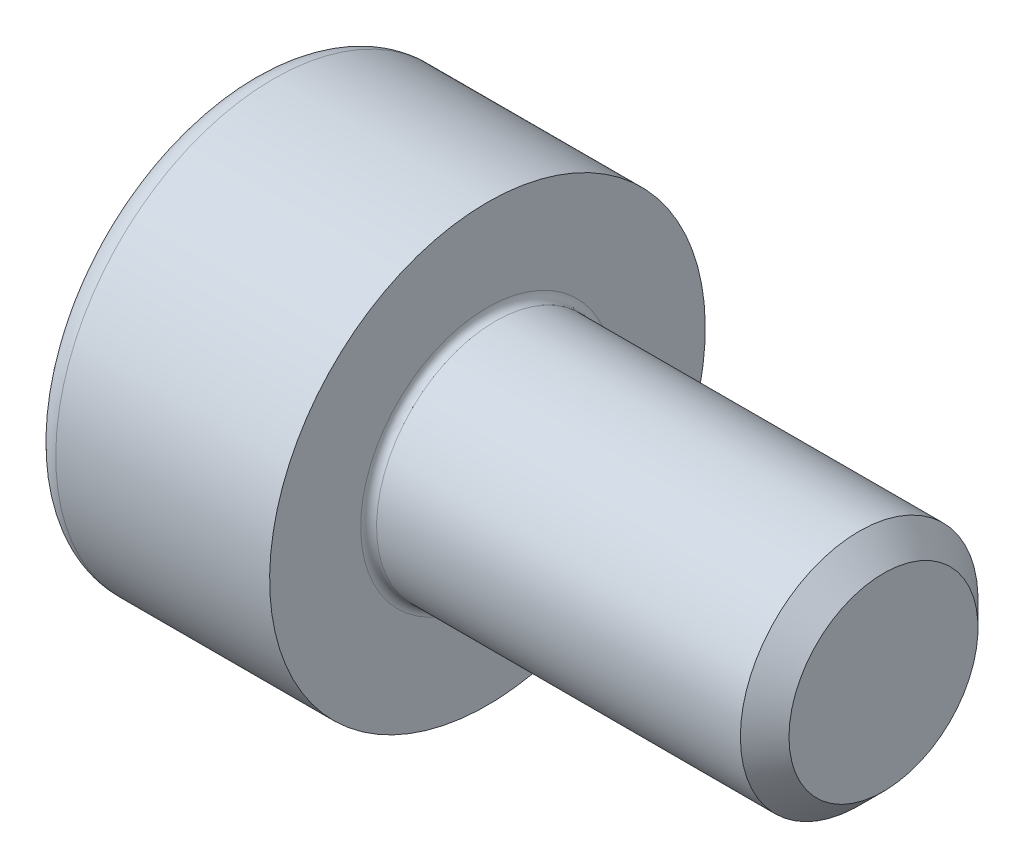
ISO-10303-21;
HEADER;
FILE_DESCRIPTION(('STEP AP214'),'2;1');
FILE_NAME('part.step','',(''),(''),'','','');
FILE_SCHEMA(('AUTOMOTIVE_DESIGN { 1 0 10303 214 1 1 1 1 }'));
ENDSEC;
DATA;
#1=APPLICATION_CONTEXT('core data for automotive mechanical design processes');
#2=APPLICATION_PROTOCOL_DEFINITION('international standard','automotive_design',2000,#1);
#3=PRODUCT_CONTEXT('',#1,'mechanical');
#4=PRODUCT('Part','Part','',(#3));
#5=PRODUCT_RELATED_PRODUCT_CATEGORY('part','',(#4));
#6=PRODUCT_DEFINITION_FORMATION('','',#4);
#7=PRODUCT_DEFINITION_CONTEXT('part definition',#1,'design');
#8=PRODUCT_DEFINITION('design','',#6,#7);
#9=PRODUCT_DEFINITION_SHAPE('','',#8);
#10=(LENGTH_UNIT() NAMED_UNIT(*) SI_UNIT(.MILLI.,.METRE.));
#11=(NAMED_UNIT(*) PLANE_ANGLE_UNIT() SI_UNIT($,.RADIAN.));
#12=(NAMED_UNIT(*) SI_UNIT($,.STERADIAN.) SOLID_ANGLE_UNIT());
#13=UNCERTAINTY_MEASURE_WITH_UNIT(LENGTH_MEASURE(1.E-05),#10,'distance_accuracy_value','');
#14=(GEOMETRIC_REPRESENTATION_CONTEXT(3) GLOBAL_UNCERTAINTY_ASSIGNED_CONTEXT((#13)) GLOBAL_UNIT_ASSIGNED_CONTEXT((#10,
#11,#12)) REPRESENTATION_CONTEXT('',''));
#15=CARTESIAN_POINT('',(0.,0.,0.));
#16=DIRECTION('',(0.,0.,1.));
#17=DIRECTION('',(1.,0.,0.));
#18=AXIS2_PLACEMENT_3D('',#15,#16,#17);
#19=CARTESIAN_POINT('',(5.,0.749999999999999,0.));
#20=DIRECTION('',(1.,0.,0.));
#21=DIRECTION('',(0.,1.,0.));
#22=AXIS2_PLACEMENT_3D('',#19,#20,#21);
#23=PLANE('',#22);
#24=CARTESIAN_POINT('',(4.99999999999545,0.,0.));
#25=DIRECTION('',(-1.,0.,0.));
#26=DIRECTION('',(0.,0.,1.));
#27=AXIS2_PLACEMENT_3D('',#24,#25,#26);
#28=CIRCLE('',#27,1.19327500004829);
#29=CARTESIAN_POINT('',(4.99999999999545,0.,1.19327500004829));
#30=VERTEX_POINT('',#29);
#31=EDGE_CURVE('E19',#30,#30,#28,.T.);
#32=ORIENTED_EDGE('',*,*,#31,.F.);
#33=EDGE_LOOP('',(#32));
#34=FACE_BOUND('',#33,.T.);
#35=ADVANCED_FACE('F16',(#34),#23,.T.);
#36=CARTESIAN_POINT('',(4.69327500002237,0.,0.));
#37=DIRECTION('',(-1.,0.,0.));
#38=DIRECTION('',(0.,0.,1.));
#39=AXIS2_PLACEMENT_3D('',#36,#37,#38);
#40=CONICAL_SURFACE('',#39,1.50000000002137,0.785398163397448);
#41=ORIENTED_EDGE('',*,*,#31,.T.);
#42=EDGE_LOOP('',(#41));
#43=FACE_BOUND('',#42,.T.);
#44=CARTESIAN_POINT('',(4.693275,0.,0.));
#45=DIRECTION('',(1.,0.,0.));
#46=DIRECTION('',(0.,1.,0.));
#47=AXIS2_PLACEMENT_3D('',#44,#45,#46);
#48=CIRCLE('',#47,1.5);
#49=CARTESIAN_POINT('',(4.693275,1.5,0.));
#50=VERTEX_POINT('',#49);
#51=EDGE_CURVE('E85',#50,#50,#48,.F.);
#52=ORIENTED_EDGE('',*,*,#51,.F.);
#53=EDGE_LOOP('',(#52));
#54=FACE_BOUND('',#53,.T.);
#55=ADVANCED_FACE('F75',(#43,#54),#40,.T.);
#56=CARTESIAN_POINT('',(-1.70499999995855,0.,0.));
#57=DIRECTION('',(-1.,0.,0.));
#58=DIRECTION('',(0.,0.,1.));
#59=AXIS2_PLACEMENT_3D('',#56,#57,#58);
#60=CONICAL_SURFACE('',#59,1.45203592694543,1.04719755110347);
#61=CARTESIAN_POINT('',(-0.866666666638594,-5.6843418860808E-11,0.));
#62=VERTEX_POINT('',#61);
#63=VERTEX_LOOP('',#62);
#64=FACE_BOUND('',#63,.T.);
#65=CARTESIAN_POINT('',(-1.69999999999617,1.25,0.721687836488135));
#66=CARTESIAN_POINT('',(-1.68168471569602,1.25,0.658260217058125));
#67=CARTESIAN_POINT('',(-1.66502792317553,1.25,0.594285091319299));
#68=CARTESIAN_POINT('',(-1.63595399210618,1.25,0.46522715333314));
#69=CARTESIAN_POINT('',(-1.62354713768941,1.25,0.400142048722467));
#70=CARTESIAN_POINT('',(-1.60423497431521,1.25,0.270778406576447));
#71=CARTESIAN_POINT('',(-1.5972011172206,1.25,0.206519767719932));
#72=CARTESIAN_POINT('',(-1.58880573005285,1.25,0.0777002896263008));
#73=CARTESIAN_POINT('',(-1.58743724620536,1.25,0.0131399182916871));
#74=CARTESIAN_POINT('',(-1.5902914313199,1.25,-0.107484209674466));
#75=CARTESIAN_POINT('',(-1.59381330323442,1.25,-0.163566066939126));
#76=CARTESIAN_POINT('',(-1.60497331292594,1.25,-0.275364426461755));
#77=CARTESIAN_POINT('',(-1.61261525920924,1.25,-0.331080542327663));
#78=CARTESIAN_POINT('',(-1.63171864581936,1.25,-0.443109217014378));
#79=CARTESIAN_POINT('',(-1.64326102637173,1.25,-0.499407604247212));
#80=CARTESIAN_POINT('',(-1.66945735051506,1.25,-0.611164931125642));
#81=CARTESIAN_POINT('',(-1.68410514296338,1.25,-0.66662530140732));
#82=CARTESIAN_POINT('',(-1.69999999999617,1.25,-0.721687836488137));
#83=B_SPLINE_CURVE_WITH_KNOTS('',3,(#65,#66,#67,#68,#69,#70,#71,#72,#73,#74,#75,#76,#77,#78,#79,
#80,#81,#82),.UNSPECIFIED.,.F.,.F.,(4,2,2,2,2,2,2,2,4),(0.,0.198135007230195,0.396746135656533,
0.590442253865266,0.783900555585791,0.952317364165593,1.12089012113824,1.29320101406964,
1.4651737334584),.UNSPECIFIED.);
#84=CARTESIAN_POINT('',(-1.69999999999617,1.25000000000048,0.721687836487309));
#85=VERTEX_POINT('',#84);
#86=CARTESIAN_POINT('',(-1.69999999999601,1.25,-0.721687836487585));
#87=VERTEX_POINT('',#86);
#88=EDGE_CURVE('E67',#85,#87,#83,.T.);
#89=ORIENTED_EDGE('',*,*,#88,.T.);
#90=CARTESIAN_POINT('',(-1.69999999999617,1.25000000000095,-0.721687836486483));
#91=CARTESIAN_POINT('',(-1.68168471569602,1.19507007027299,-0.753401646201488));
#92=CARTESIAN_POINT('',(-1.66502792317553,1.13966598617287,-0.785389209070901));
#93=CARTESIAN_POINT('',(-1.63595399210618,1.02789853331682,-0.84991817806398));
#94=CARTESIAN_POINT('',(-1.62354713768941,0.971533179316005,-0.882460730369317));
#95=CARTESIAN_POINT('',(-1.60423497431521,0.859500978891473,-0.947142551442327));
#96=CARTESIAN_POINT('',(-1.5972011172206,0.803851365229121,-0.979271870870584));
#97=CARTESIAN_POINT('',(-1.58880573005285,0.692290424697783,-1.0436816099174));
#98=CARTESIAN_POINT('',(-1.58743724620536,0.636379503044251,-1.07596179558471));
#99=CARTESIAN_POINT('',(-1.5902914313199,0.531915943916217,-1.13627385956778));
#100=CARTESIAN_POINT('',(-1.59381330323442,0.483347630833609,-1.16431478820011));
#101=CARTESIAN_POINT('',(-1.60497331292594,0.386527411385587,-1.22021396796143));
#102=CARTESIAN_POINT('',(-1.61261525920924,0.338275839645513,-1.24807202589438));
#103=CARTESIAN_POINT('',(-1.63171864581936,0.241256161414515,-1.30408636323774));
#104=CARTESIAN_POINT('',(-1.64326102637173,0.192500327878788,-1.33223555685416));
#105=CARTESIAN_POINT('',(-1.66945735051506,0.0957156437430261,-1.38811422029337));
#106=CARTESIAN_POINT('',(-1.68410514296338,0.0476855541758015,-1.41584440543421));
#107=CARTESIAN_POINT('',(-1.69999999999617,-9.57268631230381E-13,-1.44337567297462));
#108=B_SPLINE_CURVE_WITH_KNOTS('',3,(#90,#91,#92,#93,#94,#95,#96,#97,#98,#99,#100,#101,#102,
#103,#104,#105,#106,#107),.UNSPECIFIED.,.F.,.F.,(4,2,2,2,2,2,2,2,4),(0.,0.198135007230194,
0.396746135656533,0.590442253865266,0.78390055558579,0.952317364165593,1.12089012113824,
1.29320101406964,1.4651737334584),.UNSPECIFIED.);
#109=CARTESIAN_POINT('',(-1.69999999999617,0.,-1.44337567297462));
#110=VERTEX_POINT('',#109);
#111=EDGE_CURVE('E80',#87,#110,#108,.T.);
#112=ORIENTED_EDGE('',*,*,#111,.T.);
#113=CARTESIAN_POINT('',(-1.69999999999617,9.51335415999703E-13,-1.44337567297462));
#114=CARTESIAN_POINT('',(-1.68168471569602,-0.0549299297270088,-1.41166186325961));
#115=CARTESIAN_POINT('',(-1.66502792317554,-0.110334013827137,-1.3796743003902));
#116=CARTESIAN_POINT('',(-1.63595399210618,-0.222101466683187,-1.31514533139712));
#117=CARTESIAN_POINT('',(-1.62354713768941,-0.278466820683998,-1.28260277909179));
#118=CARTESIAN_POINT('',(-1.60423497431521,-0.39049902110853,-1.21792095801877));
#119=CARTESIAN_POINT('',(-1.5972011172206,-0.446148634770882,-1.18579163859052));
#120=CARTESIAN_POINT('',(-1.58880573005286,-0.55770957530222,-1.1213818995437));
#121=CARTESIAN_POINT('',(-1.58743724620536,-0.613620496955752,-1.08910171387639));
#122=CARTESIAN_POINT('',(-1.5902914313199,-0.718084056083786,-1.02878964989332));
#123=CARTESIAN_POINT('',(-1.59381330323442,-0.766652369166395,-1.00074872126099));
#124=CARTESIAN_POINT('',(-1.60497331292594,-0.863472588614416,-0.944849541499674));
#125=CARTESIAN_POINT('',(-1.61261525920924,-0.91172416035449,-0.91699148356672));
#126=CARTESIAN_POINT('',(-1.63171864581936,-1.00874383858549,-0.860977146223363));
#127=CARTESIAN_POINT('',(-1.64326102637173,-1.05749967212121,-0.832827952606947));
#128=CARTESIAN_POINT('',(-1.66945735051506,-1.15428435625698,-0.776949289167732));
#129=CARTESIAN_POINT('',(-1.68410514296338,-1.2023144458242,-0.749219104026893));
#130=CARTESIAN_POINT('',(-1.69999999999617,-1.25000000000096,-0.721687836486485));
#131=B_SPLINE_CURVE_WITH_KNOTS('',3,(#113,#114,#115,#116,#117,#118,#119,#120,#121,#122,#123,
#124,#125,#126,#127,#128,#129,#130),.UNSPECIFIED.,.F.,.F.,(4,2,2,2,2,2,2,2,4),(0.,
0.198135007230195,0.396746135656534,0.590442253865268,0.783900555585792,0.952317364165594,
1.12089012113824,1.29320101406964,1.4651737334584),.UNSPECIFIED.);
#132=CARTESIAN_POINT('',(-1.69999999999617,-1.25000000000048,-0.721687836487312));
#133=VERTEX_POINT('',#132);
#134=EDGE_CURVE('E108',#110,#133,#131,.T.);
#135=ORIENTED_EDGE('',*,*,#134,.T.);
#136=CARTESIAN_POINT('',(-1.69999999999617,-1.25,-0.721687836488139));
#137=CARTESIAN_POINT('',(-1.68168471569602,-1.25,-0.65826021705813));
#138=CARTESIAN_POINT('',(-1.66502792317553,-1.25,-0.594285091319303));
#139=CARTESIAN_POINT('',(-1.63595399210618,-1.25,-0.465227153333144));
#140=CARTESIAN_POINT('',(-1.62354713768941,-1.25,-0.400142048722471));
#141=CARTESIAN_POINT('',(-1.60423497431521,-1.25,-0.270778406576451));
#142=CARTESIAN_POINT('',(-1.5972011172206,-1.25,-0.206519767719936));
#143=CARTESIAN_POINT('',(-1.58880573005285,-1.25,-0.0777002896263046));
#144=CARTESIAN_POINT('',(-1.58743724620536,-1.25,-0.0131399182916908));
#145=CARTESIAN_POINT('',(-1.5902914313199,-1.25,0.107484209674463));
#146=CARTESIAN_POINT('',(-1.59381330323442,-1.25,0.163566066939124));
#147=CARTESIAN_POINT('',(-1.60497331292594,-1.25,0.275364426461753));
#148=CARTESIAN_POINT('',(-1.61261525920924,-1.25,0.331080542327662));
#149=CARTESIAN_POINT('',(-1.63171864581936,-1.25,0.443109217014378));
#150=CARTESIAN_POINT('',(-1.64326102637173,-1.25,0.499407604247211));
#151=CARTESIAN_POINT('',(-1.66945735051506,-1.25,0.611164931125643));
#152=CARTESIAN_POINT('',(-1.68410514296338,-1.25,0.666625301407321));
#153=CARTESIAN_POINT('',(-1.69999999999617,-1.25,0.721687836488138));
#154=B_SPLINE_CURVE_WITH_KNOTS('',3,(#136,#137,#138,#139,#140,#141,#142,#143,#144,#145,#146,
#147,#148,#149,#150,#151,#152,#153),.UNSPECIFIED.,.F.,.F.,(4,2,2,2,2,2,2,2,4),(0.,
0.198135007230195,0.396746135656533,0.590442253865267,0.783900555585792,0.952317364165596,
1.12089012113824,1.29320101406964,1.46517373345841),.UNSPECIFIED.);
#155=CARTESIAN_POINT('',(-1.69999999999617,-1.25000000000048,0.721687836487309));
#156=VERTEX_POINT('',#155);
#157=EDGE_CURVE('E132',#133,#156,#154,.T.);
#158=ORIENTED_EDGE('',*,*,#157,.T.);
#159=CARTESIAN_POINT('',(-1.69999999999617,-1.25000000000096,0.72168783648648));
#160=CARTESIAN_POINT('',(-1.68168471569602,-1.195070070273,0.753401646201485));
#161=CARTESIAN_POINT('',(-1.66502792317553,-1.13966598617287,0.785389209070899));
#162=CARTESIAN_POINT('',(-1.63595399210618,-1.02789853331682,0.849918178063978));
#163=CARTESIAN_POINT('',(-1.62354713768941,-0.971533179316009,0.882460730369314));
#164=CARTESIAN_POINT('',(-1.60423497431521,-0.859500978891477,0.947142551442324));
#165=CARTESIAN_POINT('',(-1.5972011172206,-0.803851365229124,0.979271870870582));
#166=CARTESIAN_POINT('',(-1.58880573005285,-0.692290424697787,1.0436816099174));
#167=CARTESIAN_POINT('',(-1.58743724620536,-0.636379503044255,1.0759617955847));
#168=CARTESIAN_POINT('',(-1.5902914313199,-0.531915943916221,1.13627385956778));
#169=CARTESIAN_POINT('',(-1.59381330323442,-0.483347630833612,1.16431478820011));
#170=CARTESIAN_POINT('',(-1.60497331292594,-0.38652741138559,1.22021396796143));
#171=CARTESIAN_POINT('',(-1.61261525920924,-0.338275839645515,1.24807202589438));
#172=CARTESIAN_POINT('',(-1.63171864581936,-0.241256161414517,1.30408636323774));
#173=CARTESIAN_POINT('',(-1.64326102637173,-0.19250032787879,1.33223555685415));
#174=CARTESIAN_POINT('',(-1.66945735051506,-0.0957156437430276,1.38811422029337));
#175=CARTESIAN_POINT('',(-1.68410514296338,-0.0476855541758027,1.41584440543421));
#176=CARTESIAN_POINT('',(-1.69999999999617,9.56251440187165E-13,1.44337567297462));
#177=B_SPLINE_CURVE_WITH_KNOTS('',3,(#159,#160,#161,#162,#163,#164,#165,#166,#167,#168,#169,
#170,#171,#172,#173,#174,#175,#176),.UNSPECIFIED.,.F.,.F.,(4,2,2,2,2,2,2,2,4),(0.,
0.198135007230195,0.396746135656533,0.590442253865267,0.783900555585791,0.952317364165594,
1.12089012113824,1.29320101406964,1.46517373345841),.UNSPECIFIED.);
#178=CARTESIAN_POINT('',(-1.69999999999617,0.,1.44337567297462));
#179=VERTEX_POINT('',#178);
#180=EDGE_CURVE('E138',#156,#179,#177,.T.);
#181=ORIENTED_EDGE('',*,*,#180,.T.);
#182=CARTESIAN_POINT('',(-1.69999999999617,-9.52687770426114E-13,1.44337567297462));
#183=CARTESIAN_POINT('',(-1.68168471569602,0.0549299297270073,1.41166186325962));
#184=CARTESIAN_POINT('',(-1.66502792317554,0.110334013827135,1.3796743003902));
#185=CARTESIAN_POINT('',(-1.63595399210618,0.222101466683186,1.31514533139712));
#186=CARTESIAN_POINT('',(-1.62354713768941,0.278466820683996,1.28260277909179));
#187=CARTESIAN_POINT('',(-1.60423497431521,0.390499021108529,1.21792095801878));
#188=CARTESIAN_POINT('',(-1.5972011172206,0.446148634770881,1.18579163859052));
#189=CARTESIAN_POINT('',(-1.58880573005286,0.557709575302219,1.1213818995437));
#190=CARTESIAN_POINT('',(-1.58743724620536,0.613620496955751,1.08910171387639));
#191=CARTESIAN_POINT('',(-1.5902914313199,0.718084056083784,1.02878964989332));
#192=CARTESIAN_POINT('',(-1.59381330323442,0.766652369166393,1.00074872126099));
#193=CARTESIAN_POINT('',(-1.60497331292594,0.863472588614414,0.944849541499674));
#194=CARTESIAN_POINT('',(-1.61261525920924,0.911724160354488,0.916991483566719));
#195=CARTESIAN_POINT('',(-1.63171864581936,1.00874383858549,0.860977146223362));
#196=CARTESIAN_POINT('',(-1.64326102637173,1.05749967212121,0.832827952606946));
#197=CARTESIAN_POINT('',(-1.66945735051506,1.15428435625697,0.776949289167731));
#198=CARTESIAN_POINT('',(-1.68410514296338,1.2023144458242,0.749219104026892));
#199=CARTESIAN_POINT('',(-1.69999999999617,1.25000000000096,0.721687836486483));
#200=B_SPLINE_CURVE_WITH_KNOTS('',3,(#182,#183,#184,#185,#186,#187,#188,#189,#190,#191,#192,
#193,#194,#195,#196,#197,#198,#199),.UNSPECIFIED.,.F.,.F.,(4,2,2,2,2,2,2,2,4),(0.,
0.198135007230195,0.396746135656534,0.590442253865268,0.783900555585793,0.952317364165595,
1.12089012113824,1.29320101406964,1.4651737334584),.UNSPECIFIED.);
#201=EDGE_CURVE('E82',#179,#85,#200,.T.);
#202=ORIENTED_EDGE('',*,*,#201,.T.);
#203=EDGE_LOOP('',(#89,#112,#135,#158,#181,#202));
#204=FACE_BOUND('',#203,.T.);
#205=ADVANCED_FACE('F71',(#64,#204),#60,.F.);
#206=CARTESIAN_POINT('',(3.125,0.,0.));
#207=DIRECTION('',(1.,0.,0.));
#208=DIRECTION('',(0.,1.,0.));
#209=AXIS2_PLACEMENT_3D('',#206,#207,#208);
#210=CYLINDRICAL_SURFACE('',#209,1.5);
#211=CARTESIAN_POINT('',(0.100000000000002,0.,0.));
#212=DIRECTION('',(1.,0.,0.));
#213=DIRECTION('',(0.,0.,-1.));
#214=AXIS2_PLACEMENT_3D('',#211,#212,#213);
#215=CIRCLE('',#214,1.5);
#216=CARTESIAN_POINT('',(0.100000000000002,0.,-1.5));
#217=VERTEX_POINT('',#216);
#218=EDGE_CURVE('E96',#217,#217,#215,.T.);
#219=ORIENTED_EDGE('',*,*,#218,.T.);
#220=EDGE_LOOP('',(#219));
#221=FACE_BOUND('',#220,.T.);
#222=ORIENTED_EDGE('',*,*,#51,.T.);
#223=EDGE_LOOP('',(#222));
#224=FACE_BOUND('',#223,.T.);
#225=ADVANCED_FACE('F74',(#221,#224),#210,.T.);
#226=CARTESIAN_POINT('',(-2.99999999999999,1.25,0.721687836487031));
#227=DIRECTION('',(0.,1.,0.));
#228=DIRECTION('',(0.,0.,1.));
#229=AXIS2_PLACEMENT_3D('',#226,#227,#228);
#230=PLANE('',#229);
#231=DIRECTION('',(1.,0.,0.));
#232=VECTOR('',#231,1.);
#233=CARTESIAN_POINT('',(-2.99999999999999,1.25,0.721687836487034));
#234=LINE('',#233,#232);
#235=CARTESIAN_POINT('',(-2.99999999999999,1.25,0.721687836487032));
#236=VERTEX_POINT('',#235);
#237=EDGE_CURVE('E84',#85,#236,#234,.F.);
#238=ORIENTED_EDGE('',*,*,#237,.T.);
#239=DIRECTION('',(0.,0.,1.));
#240=VECTOR('',#239,1.);
#241=CARTESIAN_POINT('',(-2.99999999999999,1.25,0.));
#242=LINE('',#241,#240);
#243=CARTESIAN_POINT('',(-2.99999999999999,1.25,-0.721687836487033));
#244=VERTEX_POINT('',#243);
#245=EDGE_CURVE('E91',#244,#236,#242,.T.);
#246=ORIENTED_EDGE('',*,*,#245,.F.);
#247=DIRECTION('',(1.,0.,0.));
#248=VECTOR('',#247,1.);
#249=CARTESIAN_POINT('',(-2.99999999999999,1.25,-0.721687836487033));
#250=LINE('',#249,#248);
#251=EDGE_CURVE('E88',#244,#87,#250,.T.);
#252=ORIENTED_EDGE('',*,*,#251,.T.);
#253=ORIENTED_EDGE('',*,*,#88,.F.);
#254=EDGE_LOOP('',(#238,#246,#252,#253));
#255=FACE_BOUND('',#254,.T.);
#256=ADVANCED_FACE('F89',(#255),#230,.F.);
#257=CARTESIAN_POINT('',(-2.99999999999999,0.,1.44337567297407));
#258=DIRECTION('',(0.,0.500000000000001,0.866025403784438));
#259=DIRECTION('',(0.,-0.866025403784438,0.500000000000001));
#260=AXIS2_PLACEMENT_3D('',#257,#258,#259);
#261=PLANE('',#260);
#262=DIRECTION('',(1.,0.,0.));
#263=VECTOR('',#262,1.);
#264=CARTESIAN_POINT('',(-2.99999999999999,0.,1.44337567297407));
#265=LINE('',#264,#263);
#266=CARTESIAN_POINT('',(-2.99999999999999,0.,1.44337567297407));
#267=VERTEX_POINT('',#266);
#268=EDGE_CURVE('E145',#179,#267,#265,.F.);
#269=ORIENTED_EDGE('',*,*,#268,.T.);
#270=DIRECTION('',(0.,-0.866025403784437,0.500000000000004));
#271=VECTOR('',#270,1.);
#272=CARTESIAN_POINT('',(-2.99999999999999,1.25,0.721687836487031));
#273=LINE('',#272,#271);
#274=EDGE_CURVE('E263',#236,#267,#273,.T.);
#275=ORIENTED_EDGE('',*,*,#274,.F.);
#276=ORIENTED_EDGE('',*,*,#237,.F.);
#277=ORIENTED_EDGE('',*,*,#201,.F.);
#278=EDGE_LOOP('',(#269,#275,#276,#277));
#279=FACE_BOUND('',#278,.T.);
#280=ADVANCED_FACE('F150',(#279),#261,.F.);
#281=CARTESIAN_POINT('',(-2.99999999999999,-1.25,0.721687836487033));
#282=DIRECTION('',(0.,-0.5,0.866025403784439));
#283=DIRECTION('',(0.,-0.866025403784439,-0.5));
#284=AXIS2_PLACEMENT_3D('',#281,#282,#283);
#285=PLANE('',#284);
#286=DIRECTION('',(1.,0.,0.));
#287=VECTOR('',#286,1.);
#288=CARTESIAN_POINT('',(-2.99999999999999,-1.25,0.721687836487033));
#289=LINE('',#288,#287);
#290=CARTESIAN_POINT('',(-2.99999999999999,-1.25,0.721687836487033));
#291=VERTEX_POINT('',#290);
#292=EDGE_CURVE('E144',#156,#291,#289,.F.);
#293=ORIENTED_EDGE('',*,*,#292,.T.);
#294=DIRECTION('',(0.,-0.866025403784437,-0.500000000000003));
#295=VECTOR('',#294,1.);
#296=CARTESIAN_POINT('',(-2.99999999999999,0.,1.44337567297407));
#297=LINE('',#296,#295);
#298=EDGE_CURVE('E278',#267,#291,#297,.T.);
#299=ORIENTED_EDGE('',*,*,#298,.F.);
#300=ORIENTED_EDGE('',*,*,#268,.F.);
#301=ORIENTED_EDGE('',*,*,#180,.F.);
#302=EDGE_LOOP('',(#293,#299,#300,#301));
#303=FACE_BOUND('',#302,.T.);
#304=ADVANCED_FACE('F146',(#303),#285,.F.);
#305=CARTESIAN_POINT('',(-2.99999999999999,-1.25,-0.721687836487032));
#306=DIRECTION('',(0.,-1.,0.));
#307=DIRECTION('',(1.,0.,0.));
#308=AXIS2_PLACEMENT_3D('',#305,#306,#307);
#309=PLANE('',#308);
#310=DIRECTION('',(1.,0.,0.));
#311=VECTOR('',#310,1.);
#312=CARTESIAN_POINT('',(-2.99999999999999,-1.25,-0.721687836487037));
#313=LINE('',#312,#311);
#314=CARTESIAN_POINT('',(-2.99999999999999,-1.25,-0.721687836487034));
#315=VERTEX_POINT('',#314);
#316=EDGE_CURVE('E245',#133,#315,#313,.F.);
#317=ORIENTED_EDGE('',*,*,#316,.T.);
#318=DIRECTION('',(0.,0.,1.));
#319=VECTOR('',#318,1.);
#320=CARTESIAN_POINT('',(-2.99999999999999,-1.25,0.));
#321=LINE('',#320,#319);
#322=EDGE_CURVE('E273',#291,#315,#321,.F.);
#323=ORIENTED_EDGE('',*,*,#322,.F.);
#324=ORIENTED_EDGE('',*,*,#292,.F.);
#325=ORIENTED_EDGE('',*,*,#157,.F.);
#326=EDGE_LOOP('',(#317,#323,#324,#325));
#327=FACE_BOUND('',#326,.T.);
#328=ADVANCED_FACE('F149',(#327),#309,.F.);
#329=CARTESIAN_POINT('',(-2.99999999999999,0.,-1.44337567297407));
#330=DIRECTION('',(0.,-0.5,-0.866025403784439));
#331=DIRECTION('',(0.,0.866025403784439,-0.5));
#332=AXIS2_PLACEMENT_3D('',#329,#330,#331);
#333=PLANE('',#332);
#334=DIRECTION('',(1.,0.,0.));
#335=VECTOR('',#334,1.);
#336=CARTESIAN_POINT('',(-2.99999999999999,0.,-1.44337567297407));
#337=LINE('',#336,#335);
#338=CARTESIAN_POINT('',(-2.99999999999999,0.,-1.44337567297407));
#339=VERTEX_POINT('',#338);
#340=EDGE_CURVE('E34',#110,#339,#337,.F.);
#341=ORIENTED_EDGE('',*,*,#340,.T.);
#342=DIRECTION('',(0.,0.866025403784437,-0.500000000000003));
#343=VECTOR('',#342,1.);
#344=CARTESIAN_POINT('',(-2.99999999999999,-1.25,-0.721687836487032));
#345=LINE('',#344,#343);
#346=EDGE_CURVE('E268',#315,#339,#345,.T.);
#347=ORIENTED_EDGE('',*,*,#346,.F.);
#348=ORIENTED_EDGE('',*,*,#316,.F.);
#349=ORIENTED_EDGE('',*,*,#134,.F.);
#350=EDGE_LOOP('',(#341,#347,#348,#349));
#351=FACE_BOUND('',#350,.T.);
#352=ADVANCED_FACE('F295',(#351),#333,.F.);
#353=CARTESIAN_POINT('',(-2.99999999999999,1.25,-0.721687836487033));
#354=DIRECTION('',(0.,0.5,-0.866025403784439));
#355=DIRECTION('',(0.,0.866025403784439,0.5));
#356=AXIS2_PLACEMENT_3D('',#353,#354,#355);
#357=PLANE('',#356);
#358=ORIENTED_EDGE('',*,*,#251,.F.);
#359=DIRECTION('',(0.,0.866025403784437,0.500000000000002));
#360=VECTOR('',#359,1.);
#361=CARTESIAN_POINT('',(-2.99999999999999,0.,-1.44337567297407));
#362=LINE('',#361,#360);
#363=EDGE_CURVE('E266',#339,#244,#362,.T.);
#364=ORIENTED_EDGE('',*,*,#363,.F.);
#365=ORIENTED_EDGE('',*,*,#340,.F.);
#366=ORIENTED_EDGE('',*,*,#111,.F.);
#367=EDGE_LOOP('',(#358,#364,#365,#366));
#368=FACE_BOUND('',#367,.T.);
#369=ADVANCED_FACE('F95',(#368),#357,.F.);
#370=CARTESIAN_POINT('',(0.100000000000002,0.,0.));
#371=DIRECTION('',(1.,0.,0.));
#372=DIRECTION('',(0.,0.,-1.));
#373=AXIS2_PLACEMENT_3D('',#370,#371,#372);
#374=TOROIDAL_SURFACE('',#373,1.6,0.1);
#375=ORIENTED_EDGE('',*,*,#218,.F.);
#376=EDGE_LOOP('',(#375));
#377=FACE_BOUND('',#376,.T.);
#378=CARTESIAN_POINT('',(0.,0.,0.));
#379=DIRECTION('',(1.,0.,0.));
#380=DIRECTION('',(0.,1.,0.));
#381=AXIS2_PLACEMENT_3D('',#378,#379,#380);
#382=CIRCLE('',#381,1.6);
#383=CARTESIAN_POINT('',(0.,1.6,0.));
#384=VERTEX_POINT('',#383);
#385=EDGE_CURVE('E193',#384,#384,#382,.F.);
#386=ORIENTED_EDGE('',*,*,#385,.F.);
#387=EDGE_LOOP('',(#386));
#388=FACE_BOUND('',#387,.T.);
#389=ADVANCED_FACE('F218',(#377,#388),#374,.F.);
#390=CARTESIAN_POINT('',(-2.99999999999999,2.09668783648703,0.));
#391=DIRECTION('',(-1.,0.,0.));
#392=DIRECTION('',(0.,-1.,0.));
#393=AXIS2_PLACEMENT_3D('',#390,#391,#392);
#394=PLANE('',#393);
#395=ORIENTED_EDGE('',*,*,#346,.T.);
#396=ORIENTED_EDGE('',*,*,#363,.T.);
#397=ORIENTED_EDGE('',*,*,#245,.T.);
#398=ORIENTED_EDGE('',*,*,#274,.T.);
#399=ORIENTED_EDGE('',*,*,#298,.T.);
#400=ORIENTED_EDGE('',*,*,#322,.T.);
#401=EDGE_LOOP('',(#395,#396,#397,#398,#399,#400));
#402=FACE_BOUND('',#401,.T.);
#403=CARTESIAN_POINT('',(-2.99999999999999,0.,0.));
#404=DIRECTION('',(1.,0.,0.));
#405=DIRECTION('',(0.,1.,0.));
#406=AXIS2_PLACEMENT_3D('',#403,#404,#405);
#407=CIRCLE('',#406,2.45);
#408=CARTESIAN_POINT('',(-2.99999999999999,2.45,0.));
#409=VERTEX_POINT('',#408);
#410=EDGE_CURVE('E206',#409,#409,#407,.T.);
#411=ORIENTED_EDGE('',*,*,#410,.F.);
#412=EDGE_LOOP('',(#411));
#413=FACE_BOUND('',#412,.T.);
#414=ADVANCED_FACE('F210',(#402,#413),#394,.T.);
#415=CARTESIAN_POINT('',(0.,2.125,0.));
#416=DIRECTION('',(1.,0.,0.));
#417=DIRECTION('',(0.,1.,0.));
#418=AXIS2_PLACEMENT_3D('',#415,#416,#417);
#419=PLANE('',#418);
#420=ORIENTED_EDGE('',*,*,#385,.T.);
#421=EDGE_LOOP('',(#420));
#422=FACE_BOUND('',#421,.T.);
#423=CARTESIAN_POINT('',(0.,0.,0.));
#424=DIRECTION('',(1.,0.,0.));
#425=DIRECTION('',(0.,1.,0.));
#426=AXIS2_PLACEMENT_3D('',#423,#424,#425);
#427=CIRCLE('',#426,2.75);
#428=CARTESIAN_POINT('',(0.,2.75,0.));
#429=VERTEX_POINT('',#428);
#430=EDGE_CURVE('E25',#429,#429,#427,.F.);
#431=ORIENTED_EDGE('',*,*,#430,.F.);
#432=EDGE_LOOP('',(#431));
#433=FACE_BOUND('',#432,.T.);
#434=ADVANCED_FACE('F175',(#422,#433),#419,.T.);
#435=CARTESIAN_POINT('',(-2.69999999999999,0.,0.));
#436=DIRECTION('',(1.,0.,0.));
#437=DIRECTION('',(0.,0.,-1.));
#438=AXIS2_PLACEMENT_3D('',#435,#436,#437);
#439=TOROIDAL_SURFACE('',#438,2.45,0.3);
#440=CARTESIAN_POINT('',(-2.69999999999999,0.,0.));
#441=DIRECTION('',(1.,0.,0.));
#442=DIRECTION('',(0.,1.,0.));
#443=AXIS2_PLACEMENT_3D('',#440,#441,#442);
#444=CIRCLE('',#443,2.75);
#445=CARTESIAN_POINT('',(-2.69999999999999,2.75,0.));
#446=VERTEX_POINT('',#445);
#447=EDGE_CURVE('E11',#446,#446,#444,.T.);
#448=ORIENTED_EDGE('',*,*,#447,.F.);
#449=EDGE_LOOP('',(#448));
#450=FACE_BOUND('',#449,.T.);
#451=ORIENTED_EDGE('',*,*,#410,.T.);
#452=EDGE_LOOP('',(#451));
#453=FACE_BOUND('',#452,.T.);
#454=ADVANCED_FACE('F169',(#450,#453),#439,.T.);
#455=CARTESIAN_POINT('',(-1.5,0.,0.));
#456=DIRECTION('',(1.,0.,0.));
#457=DIRECTION('',(0.,1.,0.));
#458=AXIS2_PLACEMENT_3D('',#455,#456,#457);
#459=CYLINDRICAL_SURFACE('',#458,2.75);
#460=ORIENTED_EDGE('',*,*,#447,.T.);
#461=EDGE_LOOP('',(#460));
#462=FACE_BOUND('',#461,.T.);
#463=ORIENTED_EDGE('',*,*,#430,.T.);
#464=EDGE_LOOP('',(#463));
#465=FACE_BOUND('',#464,.T.);
#466=ADVANCED_FACE('F167',(#462,#465),#459,.T.);
#467=CLOSED_SHELL('',(#35,#55,#205,#225,#256,#280,#304,#328,#352,#369,#389,#414,#434,#454,#466));
#468=MANIFOLD_SOLID_BREP('B1',#467);
#469=ADVANCED_BREP_SHAPE_REPRESENTATION('',(#18,#468),#14);
#470=SHAPE_DEFINITION_REPRESENTATION(#9,#469);
ENDSEC;
END-ISO-10303-21;
